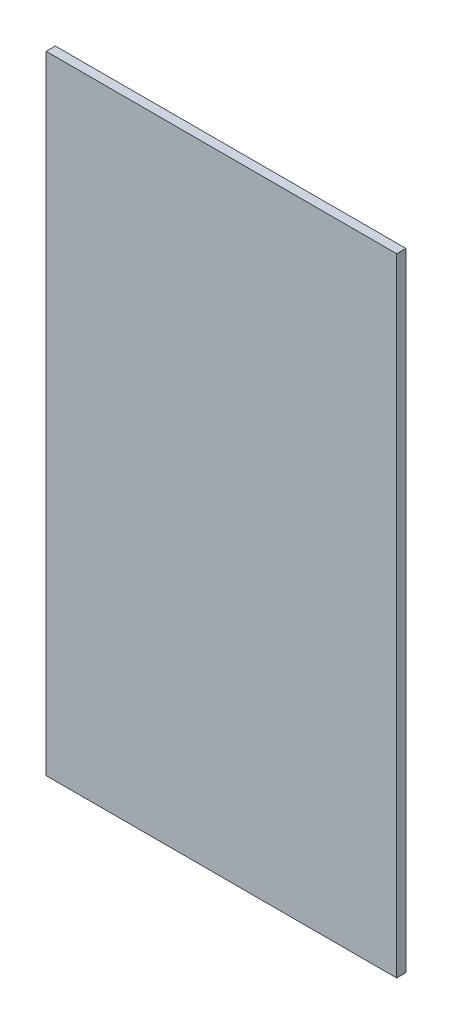
ISO-10303-21;
HEADER;
FILE_DESCRIPTION(('STEP AP214'),'2;1');
FILE_NAME('part.step','',(''),(''),'','','');
FILE_SCHEMA(('AUTOMOTIVE_DESIGN { 1 0 10303 214 1 1 1 1 }'));
ENDSEC;
DATA;
#1=APPLICATION_CONTEXT('core data for automotive mechanical design processes');
#2=APPLICATION_PROTOCOL_DEFINITION('international standard','automotive_design',2000,#1);
#3=PRODUCT_CONTEXT('',#1,'mechanical');
#4=PRODUCT('Part','Part','',(#3));
#5=PRODUCT_RELATED_PRODUCT_CATEGORY('part','',(#4));
#6=PRODUCT_DEFINITION_FORMATION('','',#4);
#7=PRODUCT_DEFINITION_CONTEXT('part definition',#1,'design');
#8=PRODUCT_DEFINITION('design','',#6,#7);
#9=PRODUCT_DEFINITION_SHAPE('','',#8);
#10=(LENGTH_UNIT() NAMED_UNIT(*) SI_UNIT(.MILLI.,.METRE.));
#11=(NAMED_UNIT(*) PLANE_ANGLE_UNIT() SI_UNIT($,.RADIAN.));
#12=(NAMED_UNIT(*) SI_UNIT($,.STERADIAN.) SOLID_ANGLE_UNIT());
#13=UNCERTAINTY_MEASURE_WITH_UNIT(LENGTH_MEASURE(1.E-05),#10,'distance_accuracy_value','');
#14=(GEOMETRIC_REPRESENTATION_CONTEXT(3) GLOBAL_UNCERTAINTY_ASSIGNED_CONTEXT((#13)) GLOBAL_UNIT_ASSIGNED_CONTEXT((#10,
#11,#12)) REPRESENTATION_CONTEXT('',''));
#15=CARTESIAN_POINT('',(0.,0.,0.));
#16=DIRECTION('',(0.,0.,1.));
#17=DIRECTION('',(1.,0.,0.));
#18=AXIS2_PLACEMENT_3D('',#15,#16,#17);
#19=CARTESIAN_POINT('',(-190.,340.,10.));
#20=DIRECTION('',(1.,0.,0.));
#21=DIRECTION('',(0.,1.,0.));
#22=AXIS2_PLACEMENT_3D('',#19,#20,#21);
#23=PLANE('',#22);
#24=DIRECTION('',(0.,-1.,0.));
#25=VECTOR('',#24,1.);
#26=CARTESIAN_POINT('',(-190.,340.,0.));
#27=LINE('',#26,#25);
#28=CARTESIAN_POINT('',(-190.,340.,0.));
#29=VERTEX_POINT('',#28);
#30=CARTESIAN_POINT('',(-190.,-340.,0.));
#31=VERTEX_POINT('',#30);
#32=EDGE_CURVE('E96',#29,#31,#27,.T.);
#33=ORIENTED_EDGE('',*,*,#32,.T.);
#34=DIRECTION('',(0.,0.,-1.));
#35=VECTOR('',#34,1.);
#36=CARTESIAN_POINT('',(-190.,-340.,10.));
#37=LINE('',#36,#35);
#38=CARTESIAN_POINT('',(-190.,-340.,10.));
#39=VERTEX_POINT('',#38);
#40=EDGE_CURVE('E11',#39,#31,#37,.T.);
#41=ORIENTED_EDGE('',*,*,#40,.F.);
#42=DIRECTION('',(0.,-1.,0.));
#43=VECTOR('',#42,1.);
#44=CARTESIAN_POINT('',(-190.,340.,10.));
#45=LINE('',#44,#43);
#46=CARTESIAN_POINT('',(-190.,340.,10.));
#47=VERTEX_POINT('',#46);
#48=EDGE_CURVE('E84',#47,#39,#45,.T.);
#49=ORIENTED_EDGE('',*,*,#48,.F.);
#50=DIRECTION('',(0.,0.,-1.));
#51=VECTOR('',#50,1.);
#52=CARTESIAN_POINT('',(-190.,340.,10.));
#53=LINE('',#52,#51);
#54=EDGE_CURVE('E92',#47,#29,#53,.T.);
#55=ORIENTED_EDGE('',*,*,#54,.T.);
#56=EDGE_LOOP('',(#33,#41,#49,#55));
#57=FACE_BOUND('',#56,.T.);
#58=ADVANCED_FACE('F33',(#57),#23,.F.);
#59=CARTESIAN_POINT('',(-190.,-340.,10.));
#60=DIRECTION('',(0.,1.,0.));
#61=DIRECTION('',(0.,0.,1.));
#62=AXIS2_PLACEMENT_3D('',#59,#60,#61);
#63=PLANE('',#62);
#64=DIRECTION('',(1.,0.,0.));
#65=VECTOR('',#64,1.);
#66=CARTESIAN_POINT('',(-190.,-340.,0.));
#67=LINE('',#66,#65);
#68=CARTESIAN_POINT('',(190.,-340.,0.));
#69=VERTEX_POINT('',#68);
#70=EDGE_CURVE('E88',#31,#69,#67,.T.);
#71=ORIENTED_EDGE('',*,*,#70,.T.);
#72=DIRECTION('',(0.,0.,-1.));
#73=VECTOR('',#72,1.);
#74=CARTESIAN_POINT('',(190.,-340.,10.));
#75=LINE('',#74,#73);
#76=CARTESIAN_POINT('',(190.,-340.,10.));
#77=VERTEX_POINT('',#76);
#78=EDGE_CURVE('E41',#77,#69,#75,.T.);
#79=ORIENTED_EDGE('',*,*,#78,.F.);
#80=DIRECTION('',(1.,0.,0.));
#81=VECTOR('',#80,1.);
#82=CARTESIAN_POINT('',(-190.,-340.,10.));
#83=LINE('',#82,#81);
#84=EDGE_CURVE('E79',#39,#77,#83,.T.);
#85=ORIENTED_EDGE('',*,*,#84,.F.);
#86=ORIENTED_EDGE('',*,*,#40,.T.);
#87=EDGE_LOOP('',(#71,#79,#85,#86));
#88=FACE_BOUND('',#87,.T.);
#89=ADVANCED_FACE('F87',(#88),#63,.F.);
#90=CARTESIAN_POINT('',(190.,340.,10.));
#91=DIRECTION('',(-1.,0.,0.));
#92=DIRECTION('',(0.,-1.,0.));
#93=AXIS2_PLACEMENT_3D('',#90,#91,#92);
#94=PLANE('',#93);
#95=DIRECTION('',(0.,1.,0.));
#96=VECTOR('',#95,1.);
#97=CARTESIAN_POINT('',(190.,340.,0.));
#98=LINE('',#97,#96);
#99=CARTESIAN_POINT('',(190.,340.,0.));
#100=VERTEX_POINT('',#99);
#101=EDGE_CURVE('E66',#69,#100,#98,.T.);
#102=ORIENTED_EDGE('',*,*,#101,.T.);
#103=DIRECTION('',(0.,0.,-1.));
#104=VECTOR('',#103,1.);
#105=CARTESIAN_POINT('',(190.,340.,10.));
#106=LINE('',#105,#104);
#107=CARTESIAN_POINT('',(190.,340.,10.));
#108=VERTEX_POINT('',#107);
#109=EDGE_CURVE('E89',#108,#100,#106,.T.);
#110=ORIENTED_EDGE('',*,*,#109,.F.);
#111=DIRECTION('',(0.,1.,0.));
#112=VECTOR('',#111,1.);
#113=CARTESIAN_POINT('',(190.,340.,10.));
#114=LINE('',#113,#112);
#115=EDGE_CURVE('E82',#77,#108,#114,.T.);
#116=ORIENTED_EDGE('',*,*,#115,.F.);
#117=ORIENTED_EDGE('',*,*,#78,.T.);
#118=EDGE_LOOP('',(#102,#110,#116,#117));
#119=FACE_BOUND('',#118,.T.);
#120=ADVANCED_FACE('F90',(#119),#94,.F.);
#121=CARTESIAN_POINT('',(-190.,340.,10.));
#122=DIRECTION('',(0.,-1.,0.));
#123=DIRECTION('',(0.,0.,-1.));
#124=AXIS2_PLACEMENT_3D('',#121,#122,#123);
#125=PLANE('',#124);
#126=DIRECTION('',(-1.,0.,0.));
#127=VECTOR('',#126,1.);
#128=CARTESIAN_POINT('',(-190.,340.,0.));
#129=LINE('',#128,#127);
#130=EDGE_CURVE('E72',#100,#29,#129,.T.);
#131=ORIENTED_EDGE('',*,*,#130,.T.);
#132=ORIENTED_EDGE('',*,*,#54,.F.);
#133=DIRECTION('',(-1.,0.,0.));
#134=VECTOR('',#133,1.);
#135=CARTESIAN_POINT('',(-190.,340.,10.));
#136=LINE('',#135,#134);
#137=EDGE_CURVE('E49',#108,#47,#136,.T.);
#138=ORIENTED_EDGE('',*,*,#137,.F.);
#139=ORIENTED_EDGE('',*,*,#109,.T.);
#140=EDGE_LOOP('',(#131,#132,#138,#139));
#141=FACE_BOUND('',#140,.T.);
#142=ADVANCED_FACE('F103',(#141),#125,.F.);
#143=CARTESIAN_POINT('',(0.,0.,10.));
#144=DIRECTION('',(0.,0.,1.));
#145=DIRECTION('',(1.,0.,0.));
#146=AXIS2_PLACEMENT_3D('',#143,#144,#145);
#147=PLANE('',#146);
#148=ORIENTED_EDGE('',*,*,#48,.T.);
#149=ORIENTED_EDGE('',*,*,#84,.T.);
#150=ORIENTED_EDGE('',*,*,#115,.T.);
#151=ORIENTED_EDGE('',*,*,#137,.T.);
#152=EDGE_LOOP('',(#148,#149,#150,#151));
#153=FACE_BOUND('',#152,.T.);
#154=ADVANCED_FACE('F80',(#153),#147,.T.);
#155=CARTESIAN_POINT('',(0.,0.,0.));
#156=DIRECTION('',(0.,0.,1.));
#157=DIRECTION('',(1.,0.,0.));
#158=AXIS2_PLACEMENT_3D('',#155,#156,#157);
#159=PLANE('',#158);
#160=ORIENTED_EDGE('',*,*,#32,.F.);
#161=ORIENTED_EDGE('',*,*,#130,.F.);
#162=ORIENTED_EDGE('',*,*,#101,.F.);
#163=ORIENTED_EDGE('',*,*,#70,.F.);
#164=EDGE_LOOP('',(#160,#161,#162,#163));
#165=FACE_BOUND('',#164,.T.);
#166=ADVANCED_FACE('F106',(#165),#159,.F.);
#167=CLOSED_SHELL('',(#58,#89,#120,#142,#154,#166));
#168=MANIFOLD_SOLID_BREP('B2',#167);
#169=ADVANCED_BREP_SHAPE_REPRESENTATION('',(#18,#168),#14);
#170=SHAPE_DEFINITION_REPRESENTATION(#9,#169);
ENDSEC;
END-ISO-10303-21;
